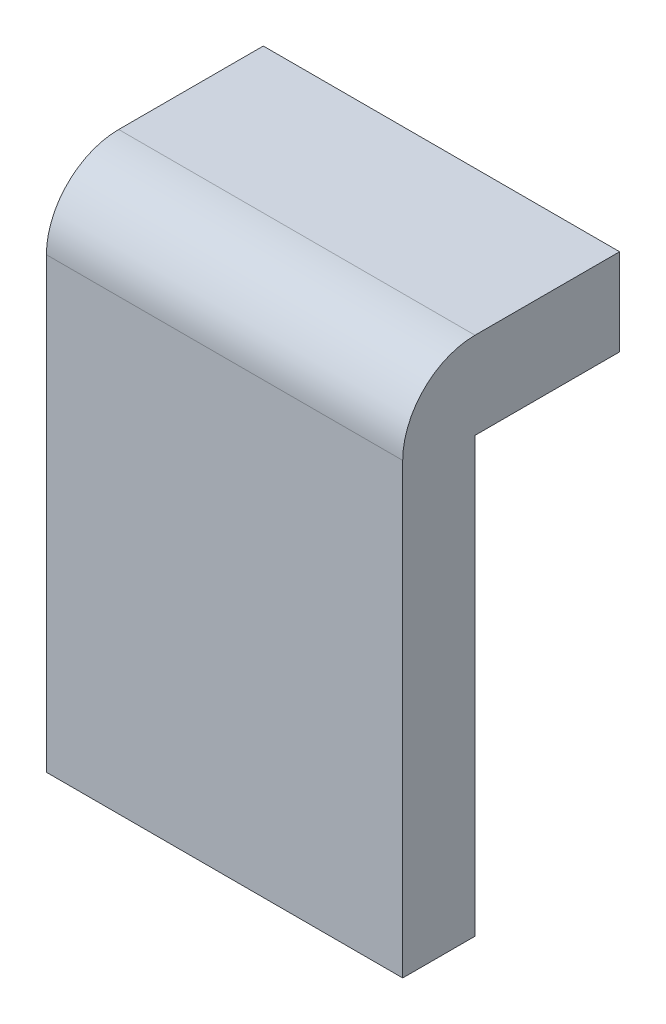
ISO-10303-21;
HEADER;
FILE_DESCRIPTION(('STEP AP214'),'2;1');
FILE_NAME('part.step','',(''),(''),'','','');
FILE_SCHEMA(('AUTOMOTIVE_DESIGN { 1 0 10303 214 1 1 1 1 }'));
ENDSEC;
DATA;
#1=APPLICATION_CONTEXT('core data for automotive mechanical design processes');
#2=APPLICATION_PROTOCOL_DEFINITION('international standard','automotive_design',2000,#1);
#3=PRODUCT_CONTEXT('',#1,'mechanical');
#4=PRODUCT('Part','Part','',(#3));
#5=PRODUCT_RELATED_PRODUCT_CATEGORY('part','',(#4));
#6=PRODUCT_DEFINITION_FORMATION('','',#4);
#7=PRODUCT_DEFINITION_CONTEXT('part definition',#1,'design');
#8=PRODUCT_DEFINITION('design','',#6,#7);
#9=PRODUCT_DEFINITION_SHAPE('','',#8);
#10=(LENGTH_UNIT() NAMED_UNIT(*) SI_UNIT(.MILLI.,.METRE.));
#11=(NAMED_UNIT(*) PLANE_ANGLE_UNIT() SI_UNIT($,.RADIAN.));
#12=(NAMED_UNIT(*) SI_UNIT($,.STERADIAN.) SOLID_ANGLE_UNIT());
#13=UNCERTAINTY_MEASURE_WITH_UNIT(LENGTH_MEASURE(1.E-05),#10,'distance_accuracy_value','');
#14=(GEOMETRIC_REPRESENTATION_CONTEXT(3) GLOBAL_UNCERTAINTY_ASSIGNED_CONTEXT((#13)) GLOBAL_UNIT_ASSIGNED_CONTEXT((#10,
#11,#12)) REPRESENTATION_CONTEXT('',''));
#15=CARTESIAN_POINT('',(0.,0.,0.));
#16=DIRECTION('',(0.,0.,1.));
#17=DIRECTION('',(1.,0.,0.));
#18=AXIS2_PLACEMENT_3D('',#15,#16,#17);
#19=CARTESIAN_POINT('',(-8.34906661620967,8.30000000000001,12.2546737770755));
#20=DIRECTION('',(0.,0.,1.));
#21=DIRECTION('',(0.,-1.,0.));
#22=AXIS2_PLACEMENT_3D('',#19,#20,#21);
#23=PLANE('',#22);
#24=DIRECTION('',(1.,0.,0.));
#25=VECTOR('',#24,1.);
#26=CARTESIAN_POINT('',(-15.8147962412963,6.80000000000003,12.2546737770755));
#27=LINE('',#26,#25);
#28=CARTESIAN_POINT('',(14.1818701655721,6.80000000000003,12.2546737770755));
#29=VERTEX_POINT('',#28);
#30=CARTESIAN_POINT('',(15.4140209220128,6.80000000000003,12.2546737770755));
#31=VERTEX_POINT('',#30);
#32=EDGE_CURVE('E113',#29,#31,#27,.T.);
#33=ORIENTED_EDGE('',*,*,#32,.F.);
#34=DIRECTION('',(0.,1.,0.));
#35=VECTOR('',#34,1.);
#36=CARTESIAN_POINT('',(14.1818701655721,5.35753839337147,12.2546737770755));
#37=LINE('',#36,#35);
#38=CARTESIAN_POINT('',(14.1818701655721,8.30000000000001,12.2546737770755));
#39=VERTEX_POINT('',#38);
#40=EDGE_CURVE('E148',#39,#29,#37,.F.);
#41=ORIENTED_EDGE('',*,*,#40,.F.);
#42=DIRECTION('',(1.,0.,0.));
#43=VECTOR('',#42,1.);
#44=CARTESIAN_POINT('',(-8.34906661620967,8.30000000000001,12.2546737770755));
#45=LINE('',#44,#43);
#46=CARTESIAN_POINT('',(15.4140209220128,8.30000000000001,12.2546737770755));
#47=VERTEX_POINT('',#46);
#48=EDGE_CURVE('E133',#39,#47,#45,.T.);
#49=ORIENTED_EDGE('',*,*,#48,.T.);
#50=DIRECTION('',(0.,1.,0.));
#51=VECTOR('',#50,1.);
#52=CARTESIAN_POINT('',(15.4140209220128,5.35753839337147,12.2546737770755));
#53=LINE('',#52,#51);
#54=EDGE_CURVE('E105',#31,#47,#53,.T.);
#55=ORIENTED_EDGE('',*,*,#54,.F.);
#56=EDGE_LOOP('',(#33,#41,#49,#55));
#57=FACE_BOUND('',#56,.T.);
#58=ADVANCED_FACE('F17',(#57),#23,.F.);
#59=CARTESIAN_POINT('',(-8.34906661620967,8.30000000000001,11.7546737770755));
#60=DIRECTION('',(0.,1.,0.));
#61=DIRECTION('',(0.,0.,1.));
#62=AXIS2_PLACEMENT_3D('',#59,#60,#61);
#63=PLANE('',#62);
#64=ORIENTED_EDGE('',*,*,#48,.F.);
#65=DIRECTION('',(0.,0.,1.));
#66=VECTOR('',#65,1.);
#67=CARTESIAN_POINT('',(14.1818701655721,8.30000000000001,12.5046737770755));
#68=LINE('',#67,#66);
#69=CARTESIAN_POINT('',(14.1818701655721,8.30000000000001,11.7546737770755));
#70=VERTEX_POINT('',#69);
#71=EDGE_CURVE('E153',#70,#39,#68,.T.);
#72=ORIENTED_EDGE('',*,*,#71,.F.);
#73=DIRECTION('',(1.,0.,0.));
#74=VECTOR('',#73,1.);
#75=CARTESIAN_POINT('',(14.1818701655721,8.30000000000001,11.7546737770755));
#76=LINE('',#75,#74);
#77=CARTESIAN_POINT('',(15.4140209220128,8.30000000000001,11.7546737770755));
#78=VERTEX_POINT('',#77);
#79=EDGE_CURVE('E124',#78,#70,#76,.F.);
#80=ORIENTED_EDGE('',*,*,#79,.F.);
#81=DIRECTION('',(0.,0.,-1.));
#82=VECTOR('',#81,1.);
#83=CARTESIAN_POINT('',(15.4140209220128,8.30000000000001,12.5046737770755));
#84=LINE('',#83,#82);
#85=EDGE_CURVE('E129',#47,#78,#84,.T.);
#86=ORIENTED_EDGE('',*,*,#85,.F.);
#87=EDGE_LOOP('',(#64,#72,#80,#86));
#88=FACE_BOUND('',#87,.T.);
#89=ADVANCED_FACE('F175',(#88),#63,.F.);
#90=CARTESIAN_POINT('',(14.1818701655721,5.35753839337146,11.7546737770755));
#91=DIRECTION('',(0.,0.,-1.));
#92=DIRECTION('',(0.,1.,0.));
#93=AXIS2_PLACEMENT_3D('',#90,#91,#92);
#94=PLANE('',#93);
#95=ORIENTED_EDGE('',*,*,#79,.T.);
#96=DIRECTION('',(0.,1.,0.));
#97=VECTOR('',#96,1.);
#98=CARTESIAN_POINT('',(14.1818701655721,5.35753839337147,11.7546737770755));
#99=LINE('',#98,#97);
#100=CARTESIAN_POINT('',(14.1818701655721,8.6,11.7546737770755));
#101=VERTEX_POINT('',#100);
#102=EDGE_CURVE('E119',#101,#70,#99,.F.);
#103=ORIENTED_EDGE('',*,*,#102,.F.);
#104=DIRECTION('',(1.,0.,0.));
#105=VECTOR('',#104,1.);
#106=CARTESIAN_POINT('',(-8.34906661620967,8.6,11.7546737770755));
#107=LINE('',#106,#105);
#108=CARTESIAN_POINT('',(15.4140209220128,8.6,11.7546737770755));
#109=VERTEX_POINT('',#108);
#110=EDGE_CURVE('E122',#101,#109,#107,.T.);
#111=ORIENTED_EDGE('',*,*,#110,.T.);
#112=DIRECTION('',(0.,1.,0.));
#113=VECTOR('',#112,1.);
#114=CARTESIAN_POINT('',(15.4140209220128,5.35753839337147,11.7546737770755));
#115=LINE('',#114,#113);
#116=EDGE_CURVE('E97',#78,#109,#115,.T.);
#117=ORIENTED_EDGE('',*,*,#116,.F.);
#118=EDGE_LOOP('',(#95,#103,#111,#117));
#119=FACE_BOUND('',#118,.T.);
#120=ADVANCED_FACE('F172',(#119),#94,.T.);
#121=CARTESIAN_POINT('',(-8.34906661620967,8.6,11.7546737770755));
#122=DIRECTION('',(0.,-1.,0.));
#123=DIRECTION('',(0.,0.,-1.));
#124=AXIS2_PLACEMENT_3D('',#121,#122,#123);
#125=PLANE('',#124);
#126=ORIENTED_EDGE('',*,*,#110,.F.);
#127=DIRECTION('',(0.,0.,1.));
#128=VECTOR('',#127,1.);
#129=CARTESIAN_POINT('',(14.1818701655721,8.6,12.5046737770755));
#130=LINE('',#129,#128);
#131=CARTESIAN_POINT('',(14.1818701655721,8.6,12.2546737770755));
#132=VERTEX_POINT('',#131);
#133=EDGE_CURVE('E83',#132,#101,#130,.F.);
#134=ORIENTED_EDGE('',*,*,#133,.F.);
#135=DIRECTION('',(1.,0.,0.));
#136=VECTOR('',#135,1.);
#137=CARTESIAN_POINT('',(-8.34906661620967,8.6,12.2546737770755));
#138=LINE('',#137,#136);
#139=CARTESIAN_POINT('',(15.4140209220128,8.6,12.2546737770755));
#140=VERTEX_POINT('',#139);
#141=EDGE_CURVE('E79',#140,#132,#138,.F.);
#142=ORIENTED_EDGE('',*,*,#141,.F.);
#143=DIRECTION('',(0.,0.,-1.));
#144=VECTOR('',#143,1.);
#145=CARTESIAN_POINT('',(15.4140209220128,8.6,12.5046737770755));
#146=LINE('',#145,#144);
#147=EDGE_CURVE('E94',#109,#140,#146,.F.);
#148=ORIENTED_EDGE('',*,*,#147,.F.);
#149=EDGE_LOOP('',(#126,#134,#142,#148));
#150=FACE_BOUND('',#149,.T.);
#151=ADVANCED_FACE('F168',(#150),#125,.F.);
#152=CARTESIAN_POINT('',(-8.34906661620967,8.35,12.2546737770755));
#153=DIRECTION('',(1.,0.,0.));
#154=DIRECTION('',(0.,0.,-1.));
#155=AXIS2_PLACEMENT_3D('',#152,#153,#154);
#156=CYLINDRICAL_SURFACE('',#155,0.249999999999995);
#157=CARTESIAN_POINT('',(14.1818701655721,8.35,12.2546737770755));
#158=DIRECTION('',(1.,0.,0.));
#159=DIRECTION('',(0.,0.,-1.));
#160=AXIS2_PLACEMENT_3D('',#157,#158,#159);
#161=CIRCLE('',#160,0.249999999999995);
#162=CARTESIAN_POINT('',(14.1818701655721,8.35,12.5046737770755));
#163=VERTEX_POINT('',#162);
#164=EDGE_CURVE('E20',#163,#132,#161,.F.);
#165=ORIENTED_EDGE('',*,*,#164,.F.);
#166=DIRECTION('',(1.,0.,0.));
#167=VECTOR('',#166,1.);
#168=CARTESIAN_POINT('',(14.1818701655721,8.35,12.5046737770755));
#169=LINE('',#168,#167);
#170=CARTESIAN_POINT('',(15.4140209220128,8.35,12.5046737770755));
#171=VERTEX_POINT('',#170);
#172=EDGE_CURVE('E77',#171,#163,#169,.F.);
#173=ORIENTED_EDGE('',*,*,#172,.F.);
#174=CARTESIAN_POINT('',(15.4140209220128,8.35,12.2546737770755));
#175=DIRECTION('',(1.,0.,0.));
#176=DIRECTION('',(0.,0.,-1.));
#177=AXIS2_PLACEMENT_3D('',#174,#175,#176);
#178=CIRCLE('',#177,0.249999999999995);
#179=EDGE_CURVE('E106',#140,#171,#178,.T.);
#180=ORIENTED_EDGE('',*,*,#179,.F.);
#181=ORIENTED_EDGE('',*,*,#141,.T.);
#182=EDGE_LOOP('',(#165,#173,#180,#181));
#183=FACE_BOUND('',#182,.T.);
#184=ADVANCED_FACE('F74',(#183),#156,.T.);
#185=CARTESIAN_POINT('',(14.1818701655721,5.35753839337147,12.5046737770755));
#186=DIRECTION('',(-1.,0.,0.));
#187=DIRECTION('',(0.,0.,1.));
#188=AXIS2_PLACEMENT_3D('',#185,#186,#187);
#189=PLANE('',#188);
#190=DIRECTION('',(0.,0.,-1.));
#191=VECTOR('',#190,1.);
#192=CARTESIAN_POINT('',(14.1818701655721,6.80000000000003,12.5046737770755));
#193=LINE('',#192,#191);
#194=CARTESIAN_POINT('',(14.1818701655721,6.80000000000003,12.5046737770755));
#195=VERTEX_POINT('',#194);
#196=EDGE_CURVE('E89',#195,#29,#193,.T.);
#197=ORIENTED_EDGE('',*,*,#196,.F.);
#198=DIRECTION('',(0.,-1.,0.));
#199=VECTOR('',#198,1.);
#200=CARTESIAN_POINT('',(14.1818701655721,5.35753839337147,12.5046737770755));
#201=LINE('',#200,#199);
#202=EDGE_CURVE('E85',#163,#195,#201,.T.);
#203=ORIENTED_EDGE('',*,*,#202,.F.);
#204=ORIENTED_EDGE('',*,*,#164,.T.);
#205=ORIENTED_EDGE('',*,*,#133,.T.);
#206=ORIENTED_EDGE('',*,*,#102,.T.);
#207=ORIENTED_EDGE('',*,*,#71,.T.);
#208=ORIENTED_EDGE('',*,*,#40,.T.);
#209=EDGE_LOOP('',(#197,#203,#204,#205,#206,#207,#208));
#210=FACE_BOUND('',#209,.T.);
#211=ADVANCED_FACE('F86',(#210),#189,.T.);
#212=CARTESIAN_POINT('',(-15.8147962412963,6.80000000000003,12.5046737770755));
#213=DIRECTION('',(0.,-1.,0.));
#214=DIRECTION('',(0.,0.,-1.));
#215=AXIS2_PLACEMENT_3D('',#212,#213,#214);
#216=PLANE('',#215);
#217=DIRECTION('',(1.,0.,0.));
#218=VECTOR('',#217,1.);
#219=CARTESIAN_POINT('',(14.1818701655721,6.80000000000003,12.5046737770755));
#220=LINE('',#219,#218);
#221=CARTESIAN_POINT('',(15.4140209220128,6.80000000000003,12.5046737770755));
#222=VERTEX_POINT('',#221);
#223=EDGE_CURVE('E26',#195,#222,#220,.T.);
#224=ORIENTED_EDGE('',*,*,#223,.F.);
#225=ORIENTED_EDGE('',*,*,#196,.T.);
#226=ORIENTED_EDGE('',*,*,#32,.T.);
#227=DIRECTION('',(0.,0.,-1.));
#228=VECTOR('',#227,1.);
#229=CARTESIAN_POINT('',(15.4140209220128,6.80000000000003,12.5046737770755));
#230=LINE('',#229,#228);
#231=EDGE_CURVE('E35',#222,#31,#230,.T.);
#232=ORIENTED_EDGE('',*,*,#231,.F.);
#233=EDGE_LOOP('',(#224,#225,#226,#232));
#234=FACE_BOUND('',#233,.T.);
#235=ADVANCED_FACE('F179',(#234),#216,.T.);
#236=CARTESIAN_POINT('',(15.4140209220128,5.35753839337147,12.5046737770755));
#237=DIRECTION('',(1.,0.,0.));
#238=DIRECTION('',(0.,0.,-1.));
#239=AXIS2_PLACEMENT_3D('',#236,#237,#238);
#240=PLANE('',#239);
#241=ORIENTED_EDGE('',*,*,#116,.T.);
#242=ORIENTED_EDGE('',*,*,#147,.T.);
#243=ORIENTED_EDGE('',*,*,#179,.T.);
#244=DIRECTION('',(0.,-1.,0.));
#245=VECTOR('',#244,1.);
#246=CARTESIAN_POINT('',(15.4140209220128,5.35753839337147,12.5046737770755));
#247=LINE('',#246,#245);
#248=EDGE_CURVE('E11',#222,#171,#247,.F.);
#249=ORIENTED_EDGE('',*,*,#248,.F.);
#250=ORIENTED_EDGE('',*,*,#231,.T.);
#251=ORIENTED_EDGE('',*,*,#54,.T.);
#252=ORIENTED_EDGE('',*,*,#85,.T.);
#253=EDGE_LOOP('',(#241,#242,#243,#249,#250,#251,#252));
#254=FACE_BOUND('',#253,.T.);
#255=ADVANCED_FACE('F164',(#254),#240,.T.);
#256=CARTESIAN_POINT('',(14.1818701655721,5.35753839337147,12.5046737770755));
#257=DIRECTION('',(0.,0.,1.));
#258=DIRECTION('',(0.,-1.,0.));
#259=AXIS2_PLACEMENT_3D('',#256,#257,#258);
#260=PLANE('',#259);
#261=ORIENTED_EDGE('',*,*,#223,.T.);
#262=ORIENTED_EDGE('',*,*,#248,.T.);
#263=ORIENTED_EDGE('',*,*,#172,.T.);
#264=ORIENTED_EDGE('',*,*,#202,.T.);
#265=EDGE_LOOP('',(#261,#262,#263,#264));
#266=FACE_BOUND('',#265,.T.);
#267=ADVANCED_FACE('F93',(#266),#260,.T.);
#268=CLOSED_SHELL('',(#58,#89,#120,#151,#184,#211,#235,#255,#267));
#269=MANIFOLD_SOLID_BREP('B1',#268);
#270=ADVANCED_BREP_SHAPE_REPRESENTATION('',(#18,#269),#14);
#271=SHAPE_DEFINITION_REPRESENTATION(#9,#270);
ENDSEC;
END-ISO-10303-21;
